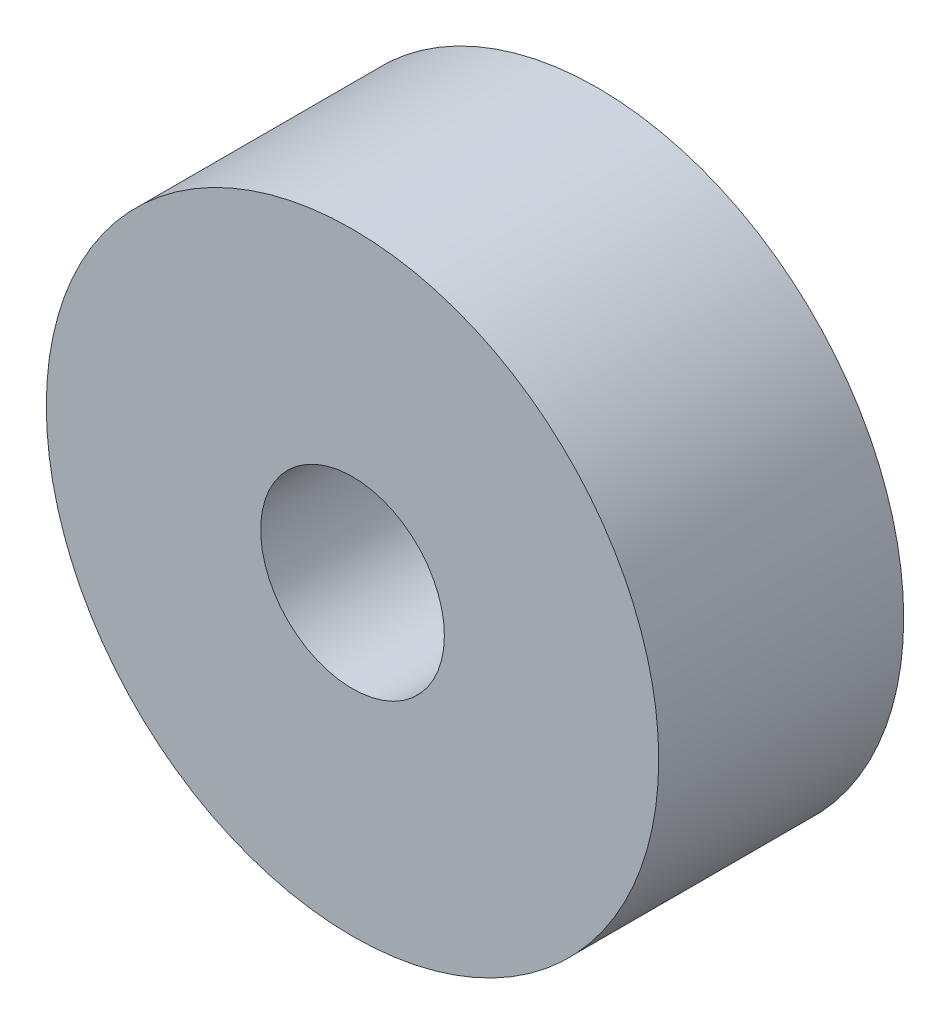
ISO-10303-21;
HEADER;
FILE_DESCRIPTION(('STEP AP214'),'2;1');
FILE_NAME('part.step','',(''),(''),'','','');
FILE_SCHEMA(('AUTOMOTIVE_DESIGN { 1 0 10303 214 1 1 1 1 }'));
ENDSEC;
DATA;
#1=APPLICATION_CONTEXT('core data for automotive mechanical design processes');
#2=APPLICATION_PROTOCOL_DEFINITION('international standard','automotive_design',2000,#1);
#3=PRODUCT_CONTEXT('',#1,'mechanical');
#4=PRODUCT('Part','Part','',(#3));
#5=PRODUCT_RELATED_PRODUCT_CATEGORY('part','',(#4));
#6=PRODUCT_DEFINITION_FORMATION('','',#4);
#7=PRODUCT_DEFINITION_CONTEXT('part definition',#1,'design');
#8=PRODUCT_DEFINITION('design','',#6,#7);
#9=PRODUCT_DEFINITION_SHAPE('','',#8);
#10=(LENGTH_UNIT() NAMED_UNIT(*) SI_UNIT(.MILLI.,.METRE.));
#11=(NAMED_UNIT(*) PLANE_ANGLE_UNIT() SI_UNIT($,.RADIAN.));
#12=(NAMED_UNIT(*) SI_UNIT($,.STERADIAN.) SOLID_ANGLE_UNIT());
#13=UNCERTAINTY_MEASURE_WITH_UNIT(LENGTH_MEASURE(1.E-05),#10,'distance_accuracy_value','');
#14=(GEOMETRIC_REPRESENTATION_CONTEXT(3) GLOBAL_UNCERTAINTY_ASSIGNED_CONTEXT((#13)) GLOBAL_UNIT_ASSIGNED_CONTEXT((#10,
#11,#12)) REPRESENTATION_CONTEXT('',''));
#15=CARTESIAN_POINT('',(0.,0.,0.));
#16=DIRECTION('',(0.,0.,1.));
#17=DIRECTION('',(1.,0.,0.));
#18=AXIS2_PLACEMENT_3D('',#15,#16,#17);
#19=CARTESIAN_POINT('',(0.,0.,4.));
#20=DIRECTION('',(0.,0.,1.));
#21=DIRECTION('',(1.,0.,0.));
#22=AXIS2_PLACEMENT_3D('',#19,#20,#21);
#23=PLANE('',#22);
#24=CARTESIAN_POINT('',(0.,0.,4.));
#25=DIRECTION('',(0.,0.,1.));
#26=DIRECTION('',(1.,0.,0.));
#27=AXIS2_PLACEMENT_3D('',#24,#25,#26);
#28=CIRCLE('',#27,5.);
#29=CARTESIAN_POINT('',(5.,0.,4.));
#30=VERTEX_POINT('',#29);
#31=EDGE_CURVE('E10',#30,#30,#28,.T.);
#32=ORIENTED_EDGE('',*,*,#31,.T.);
#33=EDGE_LOOP('',(#32));
#34=FACE_BOUND('',#33,.T.);
#35=CARTESIAN_POINT('',(0.,0.,4.));
#36=DIRECTION('',(0.,0.,1.));
#37=DIRECTION('',(1.,0.,0.));
#38=AXIS2_PLACEMENT_3D('',#35,#36,#37);
#39=CIRCLE('',#38,1.5);
#40=CARTESIAN_POINT('',(1.5,0.,4.));
#41=VERTEX_POINT('',#40);
#42=EDGE_CURVE('E45',#41,#41,#39,.T.);
#43=ORIENTED_EDGE('',*,*,#42,.F.);
#44=EDGE_LOOP('',(#43));
#45=FACE_BOUND('',#44,.T.);
#46=ADVANCED_FACE('F34',(#34,#45),#23,.T.);
#47=CARTESIAN_POINT('',(0.,0.,0.));
#48=DIRECTION('',(0.,0.,1.));
#49=DIRECTION('',(1.,0.,0.));
#50=AXIS2_PLACEMENT_3D('',#47,#48,#49);
#51=PLANE('',#50);
#52=CARTESIAN_POINT('',(0.,0.,0.));
#53=DIRECTION('',(0.,0.,1.));
#54=DIRECTION('',(1.,0.,0.));
#55=AXIS2_PLACEMENT_3D('',#52,#53,#54);
#56=CIRCLE('',#55,5.);
#57=CARTESIAN_POINT('',(5.,0.,0.));
#58=VERTEX_POINT('',#57);
#59=EDGE_CURVE('E38',#58,#58,#56,.T.);
#60=ORIENTED_EDGE('',*,*,#59,.F.);
#61=EDGE_LOOP('',(#60));
#62=FACE_BOUND('',#61,.T.);
#63=CARTESIAN_POINT('',(0.,0.,0.));
#64=DIRECTION('',(0.,0.,1.));
#65=DIRECTION('',(1.,0.,0.));
#66=AXIS2_PLACEMENT_3D('',#63,#64,#65);
#67=CIRCLE('',#66,1.5);
#68=CARTESIAN_POINT('',(1.5,0.,0.));
#69=VERTEX_POINT('',#68);
#70=EDGE_CURVE('E47',#69,#69,#67,.T.);
#71=ORIENTED_EDGE('',*,*,#70,.T.);
#72=EDGE_LOOP('',(#71));
#73=FACE_BOUND('',#72,.T.);
#74=ADVANCED_FACE('F57',(#62,#73),#51,.F.);
#75=CARTESIAN_POINT('',(0.,0.,4.));
#76=DIRECTION('',(0.,0.,-1.));
#77=DIRECTION('',(-1.,0.,0.));
#78=AXIS2_PLACEMENT_3D('',#75,#76,#77);
#79=CYLINDRICAL_SURFACE('',#78,5.);
#80=ORIENTED_EDGE('',*,*,#31,.F.);
#81=EDGE_LOOP('',(#80));
#82=FACE_BOUND('',#81,.T.);
#83=ORIENTED_EDGE('',*,*,#59,.T.);
#84=EDGE_LOOP('',(#83));
#85=FACE_BOUND('',#84,.T.);
#86=ADVANCED_FACE('F36',(#82,#85),#79,.T.);
#87=CARTESIAN_POINT('',(0.,0.,4.));
#88=DIRECTION('',(0.,0.,-1.));
#89=DIRECTION('',(-1.,0.,0.));
#90=AXIS2_PLACEMENT_3D('',#87,#88,#89);
#91=CYLINDRICAL_SURFACE('',#90,1.5);
#92=ORIENTED_EDGE('',*,*,#42,.T.);
#93=EDGE_LOOP('',(#92));
#94=FACE_BOUND('',#93,.T.);
#95=ORIENTED_EDGE('',*,*,#70,.F.);
#96=EDGE_LOOP('',(#95));
#97=FACE_BOUND('',#96,.T.);
#98=ADVANCED_FACE('F53',(#94,#97),#91,.F.);
#99=CLOSED_SHELL('',(#46,#74,#86,#98));
#100=MANIFOLD_SOLID_BREP('B2',#99);
#101=ADVANCED_BREP_SHAPE_REPRESENTATION('',(#18,#100),#14);
#102=SHAPE_DEFINITION_REPRESENTATION(#9,#101);
ENDSEC;
END-ISO-10303-21;
